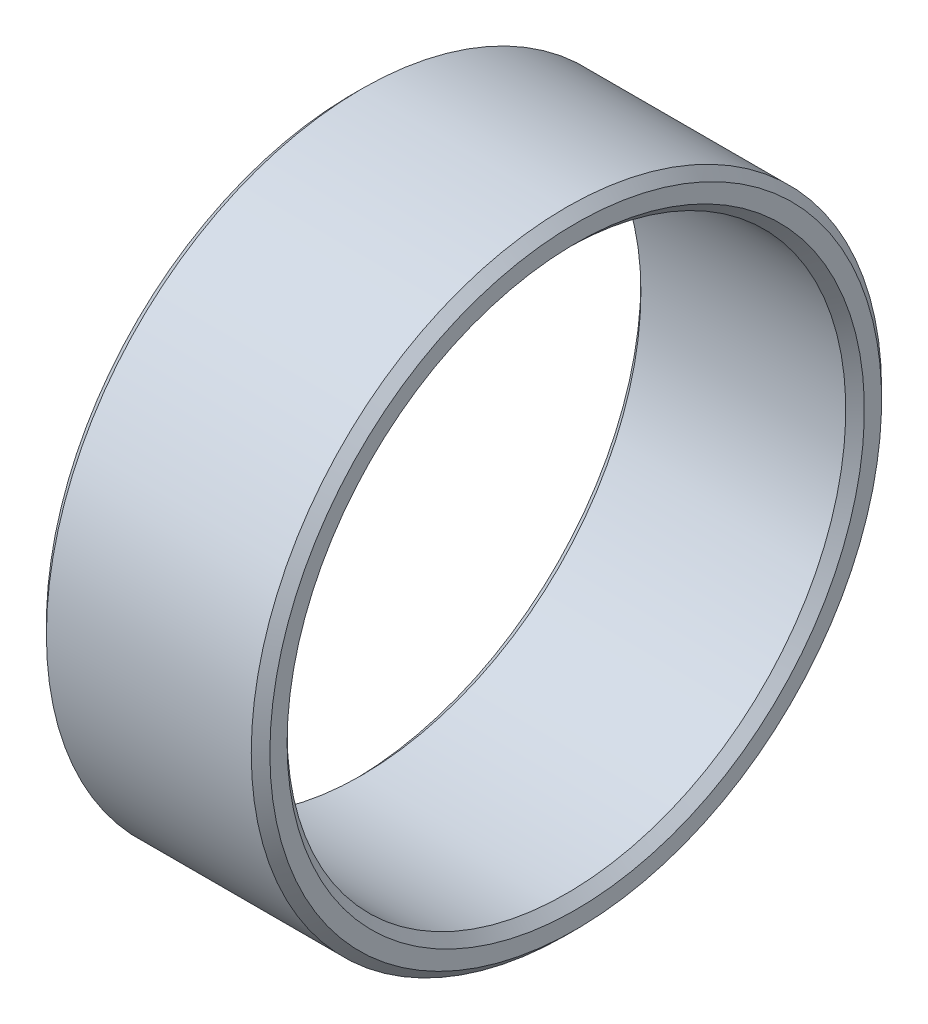
ISO-10303-21;
HEADER;
FILE_DESCRIPTION(('STEP AP214'),'2;1');
FILE_NAME('part.step','',(''),(''),'','','');
FILE_SCHEMA(('AUTOMOTIVE_DESIGN { 1 0 10303 214 1 1 1 1 }'));
ENDSEC;
DATA;
#1=APPLICATION_CONTEXT('core data for automotive mechanical design processes');
#2=APPLICATION_PROTOCOL_DEFINITION('international standard','automotive_design',2000,#1);
#3=PRODUCT_CONTEXT('',#1,'mechanical');
#4=PRODUCT('Part','Part','',(#3));
#5=PRODUCT_RELATED_PRODUCT_CATEGORY('part','',(#4));
#6=PRODUCT_DEFINITION_FORMATION('','',#4);
#7=PRODUCT_DEFINITION_CONTEXT('part definition',#1,'design');
#8=PRODUCT_DEFINITION('design','',#6,#7);
#9=PRODUCT_DEFINITION_SHAPE('','',#8);
#10=(LENGTH_UNIT() NAMED_UNIT(*) SI_UNIT(.MILLI.,.METRE.));
#11=(NAMED_UNIT(*) PLANE_ANGLE_UNIT() SI_UNIT($,.RADIAN.));
#12=(NAMED_UNIT(*) SI_UNIT($,.STERADIAN.) SOLID_ANGLE_UNIT());
#13=UNCERTAINTY_MEASURE_WITH_UNIT(LENGTH_MEASURE(1.E-05),#10,'distance_accuracy_value','');
#14=(GEOMETRIC_REPRESENTATION_CONTEXT(3) GLOBAL_UNCERTAINTY_ASSIGNED_CONTEXT((#13)) GLOBAL_UNIT_ASSIGNED_CONTEXT((#10,
#11,#12)) REPRESENTATION_CONTEXT('',''));
#15=CARTESIAN_POINT('',(0.,0.,0.));
#16=DIRECTION('',(0.,0.,1.));
#17=DIRECTION('',(1.,0.,0.));
#18=AXIS2_PLACEMENT_3D('',#15,#16,#17);
#19=CARTESIAN_POINT('',(-6.,16.925,0.));
#20=DIRECTION('',(1.,0.,0.));
#21=DIRECTION('',(0.,0.,-1.));
#22=AXIS2_PLACEMENT_3D('',#19,#20,#21);
#23=PLANE('',#22);
#24=CARTESIAN_POINT('',(-6.,0.,0.));
#25=DIRECTION('',(1.,0.,0.));
#26=DIRECTION('',(0.,0.,-1.));
#27=AXIS2_PLACEMENT_3D('',#24,#25,#26);
#28=CIRCLE('',#27,15.5);
#29=CARTESIAN_POINT('',(-6.,0.,-15.5));
#30=VERTEX_POINT('',#29);
#31=EDGE_CURVE('E50',#30,#30,#28,.T.);
#32=ORIENTED_EDGE('',*,*,#31,.T.);
#33=EDGE_LOOP('',(#32));
#34=FACE_BOUND('',#33,.T.);
#35=CARTESIAN_POINT('',(-6.,0.,0.));
#36=DIRECTION('',(1.,0.,0.));
#37=DIRECTION('',(0.,0.,-1.));
#38=AXIS2_PLACEMENT_3D('',#35,#36,#37);
#39=CIRCLE('',#38,16.425);
#40=CARTESIAN_POINT('',(-6.,0.,-16.425));
#41=VERTEX_POINT('',#40);
#42=EDGE_CURVE('E53',#41,#41,#39,.F.);
#43=ORIENTED_EDGE('',*,*,#42,.T.);
#44=EDGE_LOOP('',(#43));
#45=FACE_BOUND('',#44,.T.);
#46=ADVANCED_FACE('F30',(#34,#45),#23,.F.);
#47=CARTESIAN_POINT('',(0.,0.,0.));
#48=DIRECTION('',(-1.,0.,0.));
#49=DIRECTION('',(0.,0.,1.));
#50=AXIS2_PLACEMENT_3D('',#47,#48,#49);
#51=CYLINDRICAL_SURFACE('',#50,15.);
#52=CARTESIAN_POINT('',(-5.49999999999999,0.,0.));
#53=DIRECTION('',(1.,0.,0.));
#54=DIRECTION('',(0.,0.,-1.));
#55=AXIS2_PLACEMENT_3D('',#52,#53,#54);
#56=CIRCLE('',#55,15.);
#57=CARTESIAN_POINT('',(-5.49999999999999,0.,-15.));
#58=VERTEX_POINT('',#57);
#59=EDGE_CURVE('E56',#58,#58,#56,.F.);
#60=ORIENTED_EDGE('',*,*,#59,.T.);
#61=EDGE_LOOP('',(#60));
#62=FACE_BOUND('',#61,.T.);
#63=CARTESIAN_POINT('',(5.49999999999999,0.,0.));
#64=DIRECTION('',(-1.,0.,0.));
#65=DIRECTION('',(0.,0.,1.));
#66=AXIS2_PLACEMENT_3D('',#63,#64,#65);
#67=CIRCLE('',#66,15.);
#68=CARTESIAN_POINT('',(5.49999999999999,0.,15.));
#69=VERTEX_POINT('',#68);
#70=EDGE_CURVE('E59',#69,#69,#67,.F.);
#71=ORIENTED_EDGE('',*,*,#70,.T.);
#72=EDGE_LOOP('',(#71));
#73=FACE_BOUND('',#72,.T.);
#74=ADVANCED_FACE('F63',(#62,#73),#51,.F.);
#75=CARTESIAN_POINT('',(6.,16.925,0.));
#76=DIRECTION('',(-1.,0.,0.));
#77=DIRECTION('',(0.,0.,1.));
#78=AXIS2_PLACEMENT_3D('',#75,#76,#77);
#79=PLANE('',#78);
#80=CARTESIAN_POINT('',(6.,0.,0.));
#81=DIRECTION('',(-1.,0.,0.));
#82=DIRECTION('',(0.,0.,1.));
#83=AXIS2_PLACEMENT_3D('',#80,#81,#82);
#84=CIRCLE('',#83,15.5);
#85=CARTESIAN_POINT('',(6.,0.,15.5));
#86=VERTEX_POINT('',#85);
#87=EDGE_CURVE('E10',#86,#86,#84,.T.);
#88=ORIENTED_EDGE('',*,*,#87,.T.);
#89=EDGE_LOOP('',(#88));
#90=FACE_BOUND('',#89,.T.);
#91=CARTESIAN_POINT('',(6.,0.,0.));
#92=DIRECTION('',(-1.,0.,0.));
#93=DIRECTION('',(0.,0.,1.));
#94=AXIS2_PLACEMENT_3D('',#91,#92,#93);
#95=CIRCLE('',#94,16.425);
#96=CARTESIAN_POINT('',(6.,0.,16.425));
#97=VERTEX_POINT('',#96);
#98=EDGE_CURVE('E37',#97,#97,#95,.F.);
#99=ORIENTED_EDGE('',*,*,#98,.T.);
#100=EDGE_LOOP('',(#99));
#101=FACE_BOUND('',#100,.T.);
#102=ADVANCED_FACE('F83',(#90,#101),#79,.F.);
#103=CARTESIAN_POINT('',(0.,0.,0.));
#104=DIRECTION('',(-1.,0.,0.));
#105=DIRECTION('',(0.,0.,1.));
#106=AXIS2_PLACEMENT_3D('',#103,#104,#105);
#107=CYLINDRICAL_SURFACE('',#106,16.925);
#108=CARTESIAN_POINT('',(-5.49999999999999,0.,0.));
#109=DIRECTION('',(1.,0.,0.));
#110=DIRECTION('',(0.,0.,-1.));
#111=AXIS2_PLACEMENT_3D('',#108,#109,#110);
#112=CIRCLE('',#111,16.925);
#113=CARTESIAN_POINT('',(-5.49999999999999,0.,-16.925));
#114=VERTEX_POINT('',#113);
#115=EDGE_CURVE('E41',#114,#114,#112,.T.);
#116=ORIENTED_EDGE('',*,*,#115,.T.);
#117=EDGE_LOOP('',(#116));
#118=FACE_BOUND('',#117,.T.);
#119=CARTESIAN_POINT('',(5.5,0.,0.));
#120=DIRECTION('',(-1.,0.,0.));
#121=DIRECTION('',(0.,0.,1.));
#122=AXIS2_PLACEMENT_3D('',#119,#120,#121);
#123=CIRCLE('',#122,16.925);
#124=CARTESIAN_POINT('',(5.5,0.,16.925));
#125=VERTEX_POINT('',#124);
#126=EDGE_CURVE('E45',#125,#125,#123,.T.);
#127=ORIENTED_EDGE('',*,*,#126,.T.);
#128=EDGE_LOOP('',(#127));
#129=FACE_BOUND('',#128,.T.);
#130=ADVANCED_FACE('F90',(#118,#129),#107,.T.);
#131=CARTESIAN_POINT('',(-5.49999999999999,0.,0.));
#132=DIRECTION('',(-1.,0.,0.));
#133=DIRECTION('',(0.,0.,1.));
#134=AXIS2_PLACEMENT_3D('',#131,#132,#133);
#135=CONICAL_SURFACE('',#134,15.,0.785398163397445);
#136=ORIENTED_EDGE('',*,*,#31,.F.);
#137=EDGE_LOOP('',(#136));
#138=FACE_BOUND('',#137,.T.);
#139=ORIENTED_EDGE('',*,*,#59,.F.);
#140=EDGE_LOOP('',(#139));
#141=FACE_BOUND('',#140,.T.);
#142=ADVANCED_FACE('F74',(#138,#141),#135,.F.);
#143=CARTESIAN_POINT('',(-6.,0.,0.));
#144=DIRECTION('',(1.,0.,0.));
#145=DIRECTION('',(0.,0.,-1.));
#146=AXIS2_PLACEMENT_3D('',#143,#144,#145);
#147=CONICAL_SURFACE('',#146,16.425,0.785398163397438);
#148=ORIENTED_EDGE('',*,*,#115,.F.);
#149=EDGE_LOOP('',(#148));
#150=FACE_BOUND('',#149,.T.);
#151=ORIENTED_EDGE('',*,*,#42,.F.);
#152=EDGE_LOOP('',(#151));
#153=FACE_BOUND('',#152,.T.);
#154=ADVANCED_FACE('F68',(#150,#153),#147,.T.);
#155=CARTESIAN_POINT('',(6.,0.,0.));
#156=DIRECTION('',(1.,0.,0.));
#157=DIRECTION('',(0.,0.,-1.));
#158=AXIS2_PLACEMENT_3D('',#155,#156,#157);
#159=CONICAL_SURFACE('',#158,15.5,0.785398163397447);
#160=ORIENTED_EDGE('',*,*,#70,.F.);
#161=EDGE_LOOP('',(#160));
#162=FACE_BOUND('',#161,.T.);
#163=ORIENTED_EDGE('',*,*,#87,.F.);
#164=EDGE_LOOP('',(#163));
#165=FACE_BOUND('',#164,.T.);
#166=ADVANCED_FACE('F65',(#162,#165),#159,.F.);
#167=CARTESIAN_POINT('',(5.5,0.,0.));
#168=DIRECTION('',(-1.,0.,0.));
#169=DIRECTION('',(0.,0.,1.));
#170=AXIS2_PLACEMENT_3D('',#167,#168,#169);
#171=CONICAL_SURFACE('',#170,16.925,0.785398163397448);
#172=ORIENTED_EDGE('',*,*,#98,.F.);
#173=EDGE_LOOP('',(#172));
#174=FACE_BOUND('',#173,.T.);
#175=ORIENTED_EDGE('',*,*,#126,.F.);
#176=EDGE_LOOP('',(#175));
#177=FACE_BOUND('',#176,.T.);
#178=ADVANCED_FACE('F32',(#174,#177),#171,.T.);
#179=CLOSED_SHELL('',(#46,#74,#102,#130,#142,#154,#166,#178));
#180=MANIFOLD_SOLID_BREP('B2',#179);
#181=ADVANCED_BREP_SHAPE_REPRESENTATION('',(#18,#180),#14);
#182=SHAPE_DEFINITION_REPRESENTATION(#9,#181);
ENDSEC;
END-ISO-10303-21;
